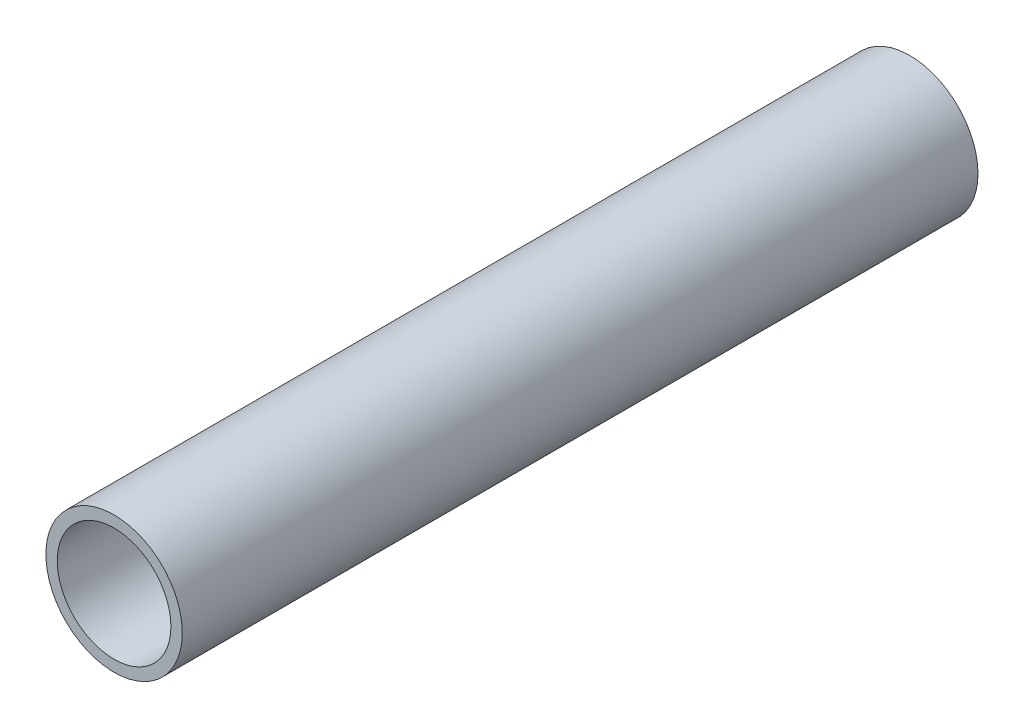
ISO-10303-21;
HEADER;
FILE_DESCRIPTION(('STEP AP214'),'2;1');
FILE_NAME('part.step','',(''),(''),'','','');
FILE_SCHEMA(('AUTOMOTIVE_DESIGN { 1 0 10303 214 1 1 1 1 }'));
ENDSEC;
DATA;
#1=APPLICATION_CONTEXT('core data for automotive mechanical design processes');
#2=APPLICATION_PROTOCOL_DEFINITION('international standard','automotive_design',2000,#1);
#3=PRODUCT_CONTEXT('',#1,'mechanical');
#4=PRODUCT('Part','Part','',(#3));
#5=PRODUCT_RELATED_PRODUCT_CATEGORY('part','',(#4));
#6=PRODUCT_DEFINITION_FORMATION('','',#4);
#7=PRODUCT_DEFINITION_CONTEXT('part definition',#1,'design');
#8=PRODUCT_DEFINITION('design','',#6,#7);
#9=PRODUCT_DEFINITION_SHAPE('','',#8);
#10=(LENGTH_UNIT() NAMED_UNIT(*) SI_UNIT(.MILLI.,.METRE.));
#11=(NAMED_UNIT(*) PLANE_ANGLE_UNIT() SI_UNIT($,.RADIAN.));
#12=(NAMED_UNIT(*) SI_UNIT($,.STERADIAN.) SOLID_ANGLE_UNIT());
#13=UNCERTAINTY_MEASURE_WITH_UNIT(LENGTH_MEASURE(1.E-05),#10,'distance_accuracy_value','');
#14=(GEOMETRIC_REPRESENTATION_CONTEXT(3) GLOBAL_UNCERTAINTY_ASSIGNED_CONTEXT((#13)) GLOBAL_UNIT_ASSIGNED_CONTEXT((#10,
#11,#12)) REPRESENTATION_CONTEXT('',''));
#15=CARTESIAN_POINT('',(0.,0.,0.));
#16=DIRECTION('',(0.,0.,1.));
#17=DIRECTION('',(1.,0.,0.));
#18=AXIS2_PLACEMENT_3D('',#15,#16,#17);
#19=CARTESIAN_POINT('',(0.,0.,140.));
#20=DIRECTION('',(0.,0.,1.));
#21=DIRECTION('',(1.,0.,0.));
#22=AXIS2_PLACEMENT_3D('',#19,#20,#21);
#23=PLANE('',#22);
#24=CARTESIAN_POINT('',(0.,0.,140.));
#25=DIRECTION('',(0.,0.,1.));
#26=DIRECTION('',(1.,0.,0.));
#27=AXIS2_PLACEMENT_3D('',#24,#25,#26);
#28=CIRCLE('',#27,12.);
#29=CARTESIAN_POINT('',(12.,0.,140.));
#30=VERTEX_POINT('',#29);
#31=EDGE_CURVE('E10',#30,#30,#28,.T.);
#32=ORIENTED_EDGE('',*,*,#31,.T.);
#33=EDGE_LOOP('',(#32));
#34=FACE_BOUND('',#33,.T.);
#35=CARTESIAN_POINT('',(0.,0.,140.));
#36=DIRECTION('',(0.,0.,1.));
#37=DIRECTION('',(1.,0.,0.));
#38=AXIS2_PLACEMENT_3D('',#35,#36,#37);
#39=CIRCLE('',#38,10.);
#40=CARTESIAN_POINT('',(10.,0.,140.));
#41=VERTEX_POINT('',#40);
#42=EDGE_CURVE('E41',#41,#41,#39,.T.);
#43=ORIENTED_EDGE('',*,*,#42,.F.);
#44=EDGE_LOOP('',(#43));
#45=FACE_BOUND('',#44,.T.);
#46=ADVANCED_FACE('F30',(#34,#45),#23,.T.);
#47=CARTESIAN_POINT('',(0.,0.,0.));
#48=DIRECTION('',(0.,0.,1.));
#49=DIRECTION('',(1.,0.,0.));
#50=AXIS2_PLACEMENT_3D('',#47,#48,#49);
#51=PLANE('',#50);
#52=CARTESIAN_POINT('',(0.,0.,0.));
#53=DIRECTION('',(0.,0.,1.));
#54=DIRECTION('',(1.,0.,0.));
#55=AXIS2_PLACEMENT_3D('',#52,#53,#54);
#56=CIRCLE('',#55,12.);
#57=CARTESIAN_POINT('',(12.,0.,0.));
#58=VERTEX_POINT('',#57);
#59=EDGE_CURVE('E34',#58,#58,#56,.T.);
#60=ORIENTED_EDGE('',*,*,#59,.F.);
#61=EDGE_LOOP('',(#60));
#62=FACE_BOUND('',#61,.T.);
#63=CARTESIAN_POINT('',(0.,0.,0.));
#64=DIRECTION('',(0.,0.,1.));
#65=DIRECTION('',(1.,0.,0.));
#66=AXIS2_PLACEMENT_3D('',#63,#64,#65);
#67=CIRCLE('',#66,10.);
#68=CARTESIAN_POINT('',(10.,0.,0.));
#69=VERTEX_POINT('',#68);
#70=EDGE_CURVE('E43',#69,#69,#67,.T.);
#71=ORIENTED_EDGE('',*,*,#70,.T.);
#72=EDGE_LOOP('',(#71));
#73=FACE_BOUND('',#72,.T.);
#74=ADVANCED_FACE('F53',(#62,#73),#51,.F.);
#75=CARTESIAN_POINT('',(0.,0.,140.));
#76=DIRECTION('',(0.,0.,-1.));
#77=DIRECTION('',(-1.,0.,0.));
#78=AXIS2_PLACEMENT_3D('',#75,#76,#77);
#79=CYLINDRICAL_SURFACE('',#78,12.);
#80=ORIENTED_EDGE('',*,*,#31,.F.);
#81=EDGE_LOOP('',(#80));
#82=FACE_BOUND('',#81,.T.);
#83=ORIENTED_EDGE('',*,*,#59,.T.);
#84=EDGE_LOOP('',(#83));
#85=FACE_BOUND('',#84,.T.);
#86=ADVANCED_FACE('F32',(#82,#85),#79,.T.);
#87=CARTESIAN_POINT('',(0.,0.,140.));
#88=DIRECTION('',(0.,0.,-1.));
#89=DIRECTION('',(-1.,0.,0.));
#90=AXIS2_PLACEMENT_3D('',#87,#88,#89);
#91=CYLINDRICAL_SURFACE('',#90,10.);
#92=ORIENTED_EDGE('',*,*,#42,.T.);
#93=EDGE_LOOP('',(#92));
#94=FACE_BOUND('',#93,.T.);
#95=ORIENTED_EDGE('',*,*,#70,.F.);
#96=EDGE_LOOP('',(#95));
#97=FACE_BOUND('',#96,.T.);
#98=ADVANCED_FACE('F49',(#94,#97),#91,.F.);
#99=CLOSED_SHELL('',(#46,#74,#86,#98));
#100=MANIFOLD_SOLID_BREP('B2',#99);
#101=ADVANCED_BREP_SHAPE_REPRESENTATION('',(#18,#100),#14);
#102=SHAPE_DEFINITION_REPRESENTATION(#9,#101);
ENDSEC;
END-ISO-10303-21;
